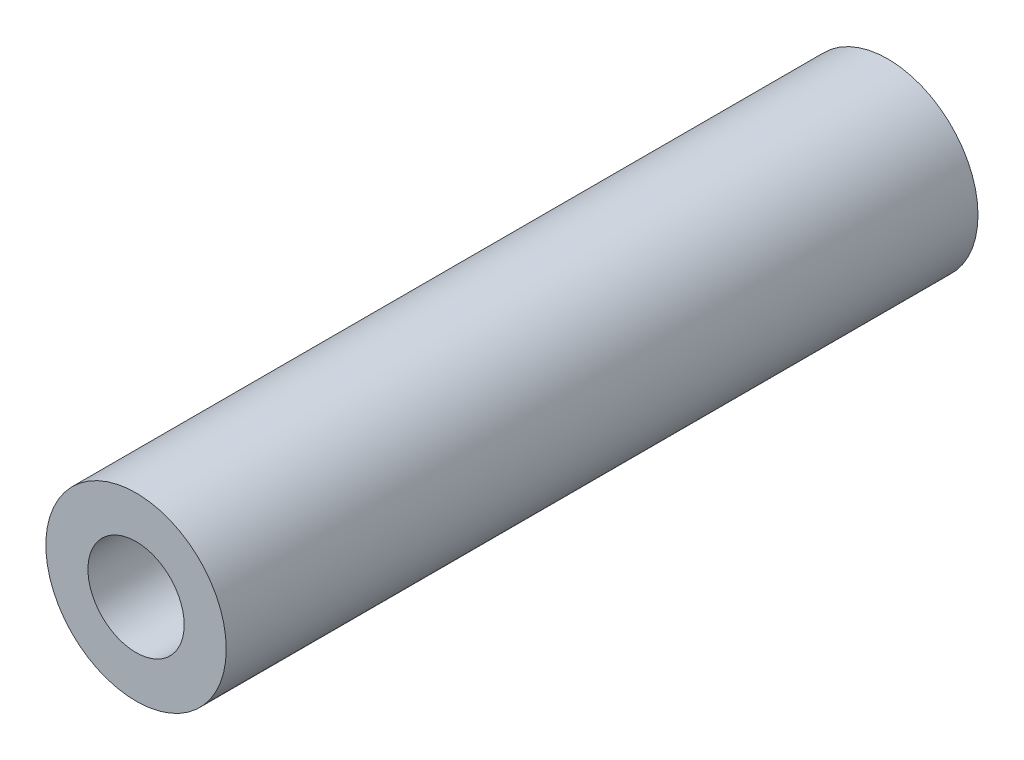
ISO-10303-21;
HEADER;
FILE_DESCRIPTION(('STEP AP214'),'2;1');
FILE_NAME('part.step','',(''),(''),'','','');
FILE_SCHEMA(('AUTOMOTIVE_DESIGN { 1 0 10303 214 1 1 1 1 }'));
ENDSEC;
DATA;
#1=APPLICATION_CONTEXT('core data for automotive mechanical design processes');
#2=APPLICATION_PROTOCOL_DEFINITION('international standard','automotive_design',2000,#1);
#3=PRODUCT_CONTEXT('',#1,'mechanical');
#4=PRODUCT('Part','Part','',(#3));
#5=PRODUCT_RELATED_PRODUCT_CATEGORY('part','',(#4));
#6=PRODUCT_DEFINITION_FORMATION('','',#4);
#7=PRODUCT_DEFINITION_CONTEXT('part definition',#1,'design');
#8=PRODUCT_DEFINITION('design','',#6,#7);
#9=PRODUCT_DEFINITION_SHAPE('','',#8);
#10=(LENGTH_UNIT() NAMED_UNIT(*) SI_UNIT(.MILLI.,.METRE.));
#11=(NAMED_UNIT(*) PLANE_ANGLE_UNIT() SI_UNIT($,.RADIAN.));
#12=(NAMED_UNIT(*) SI_UNIT($,.STERADIAN.) SOLID_ANGLE_UNIT());
#13=UNCERTAINTY_MEASURE_WITH_UNIT(LENGTH_MEASURE(1.E-05),#10,'distance_accuracy_value','');
#14=(GEOMETRIC_REPRESENTATION_CONTEXT(3) GLOBAL_UNCERTAINTY_ASSIGNED_CONTEXT((#13)) GLOBAL_UNIT_ASSIGNED_CONTEXT((#10,
#11,#12)) REPRESENTATION_CONTEXT('',''));
#15=CARTESIAN_POINT('',(0.,0.,0.));
#16=DIRECTION('',(0.,0.,1.));
#17=DIRECTION('',(1.,0.,0.));
#18=AXIS2_PLACEMENT_3D('',#15,#16,#17);
#19=CARTESIAN_POINT('',(0.,0.,12.5));
#20=DIRECTION('',(0.,0.,1.));
#21=DIRECTION('',(1.,0.,0.));
#22=AXIS2_PLACEMENT_3D('',#19,#20,#21);
#23=PLANE('',#22);
#24=CARTESIAN_POINT('',(0.,0.,12.5));
#25=DIRECTION('',(0.,0.,1.));
#26=DIRECTION('',(1.,0.,0.));
#27=AXIS2_PLACEMENT_3D('',#24,#25,#26);
#28=CIRCLE('',#27,3.);
#29=CARTESIAN_POINT('',(3.,0.,12.5));
#30=VERTEX_POINT('',#29);
#31=EDGE_CURVE('E10',#30,#30,#28,.T.);
#32=ORIENTED_EDGE('',*,*,#31,.T.);
#33=EDGE_LOOP('',(#32));
#34=FACE_BOUND('',#33,.T.);
#35=CARTESIAN_POINT('',(0.,0.,12.5));
#36=DIRECTION('',(0.,0.,1.));
#37=DIRECTION('',(1.,0.,0.));
#38=AXIS2_PLACEMENT_3D('',#35,#36,#37);
#39=CIRCLE('',#38,1.6);
#40=CARTESIAN_POINT('',(1.6,0.,12.5));
#41=VERTEX_POINT('',#40);
#42=EDGE_CURVE('E37',#41,#41,#39,.T.);
#43=ORIENTED_EDGE('',*,*,#42,.F.);
#44=EDGE_LOOP('',(#43));
#45=FACE_BOUND('',#44,.T.);
#46=ADVANCED_FACE('F30',(#34,#45),#23,.T.);
#47=CARTESIAN_POINT('',(0.,0.,12.5));
#48=DIRECTION('',(0.,0.,-1.));
#49=DIRECTION('',(-1.,0.,0.));
#50=AXIS2_PLACEMENT_3D('',#47,#48,#49);
#51=CYLINDRICAL_SURFACE('',#50,3.);
#52=ORIENTED_EDGE('',*,*,#31,.F.);
#53=EDGE_LOOP('',(#52));
#54=FACE_BOUND('',#53,.T.);
#55=CARTESIAN_POINT('',(0.,0.,-12.5));
#56=DIRECTION('',(0.,0.,1.));
#57=DIRECTION('',(1.,0.,0.));
#58=AXIS2_PLACEMENT_3D('',#55,#56,#57);
#59=CIRCLE('',#58,3.);
#60=CARTESIAN_POINT('',(3.,0.,-12.5));
#61=VERTEX_POINT('',#60);
#62=EDGE_CURVE('E41',#61,#61,#59,.T.);
#63=ORIENTED_EDGE('',*,*,#62,.T.);
#64=EDGE_LOOP('',(#63));
#65=FACE_BOUND('',#64,.T.);
#66=ADVANCED_FACE('F32',(#54,#65),#51,.T.);
#67=CARTESIAN_POINT('',(0.,0.,12.5));
#68=DIRECTION('',(0.,0.,-1.));
#69=DIRECTION('',(-1.,0.,0.));
#70=AXIS2_PLACEMENT_3D('',#67,#68,#69);
#71=CYLINDRICAL_SURFACE('',#70,1.6);
#72=ORIENTED_EDGE('',*,*,#42,.T.);
#73=EDGE_LOOP('',(#72));
#74=FACE_BOUND('',#73,.T.);
#75=CARTESIAN_POINT('',(0.,0.,-12.5));
#76=DIRECTION('',(0.,0.,1.));
#77=DIRECTION('',(1.,0.,0.));
#78=AXIS2_PLACEMENT_3D('',#75,#76,#77);
#79=CIRCLE('',#78,1.6);
#80=CARTESIAN_POINT('',(1.6,0.,-12.5));
#81=VERTEX_POINT('',#80);
#82=EDGE_CURVE('E45',#81,#81,#79,.T.);
#83=ORIENTED_EDGE('',*,*,#82,.F.);
#84=EDGE_LOOP('',(#83));
#85=FACE_BOUND('',#84,.T.);
#86=ADVANCED_FACE('F54',(#74,#85),#71,.F.);
#87=CARTESIAN_POINT('',(0.,0.,-12.5));
#88=DIRECTION('',(0.,0.,1.));
#89=DIRECTION('',(1.,0.,0.));
#90=AXIS2_PLACEMENT_3D('',#87,#88,#89);
#91=PLANE('',#90);
#92=ORIENTED_EDGE('',*,*,#82,.T.);
#93=EDGE_LOOP('',(#92));
#94=FACE_BOUND('',#93,.T.);
#95=ORIENTED_EDGE('',*,*,#62,.F.);
#96=EDGE_LOOP('',(#95));
#97=FACE_BOUND('',#96,.T.);
#98=ADVANCED_FACE('F51',(#94,#97),#91,.F.);
#99=CLOSED_SHELL('',(#46,#66,#86,#98));
#100=MANIFOLD_SOLID_BREP('B2',#99);
#101=ADVANCED_BREP_SHAPE_REPRESENTATION('',(#18,#100),#14);
#102=SHAPE_DEFINITION_REPRESENTATION(#9,#101);
ENDSEC;
END-ISO-10303-21;
